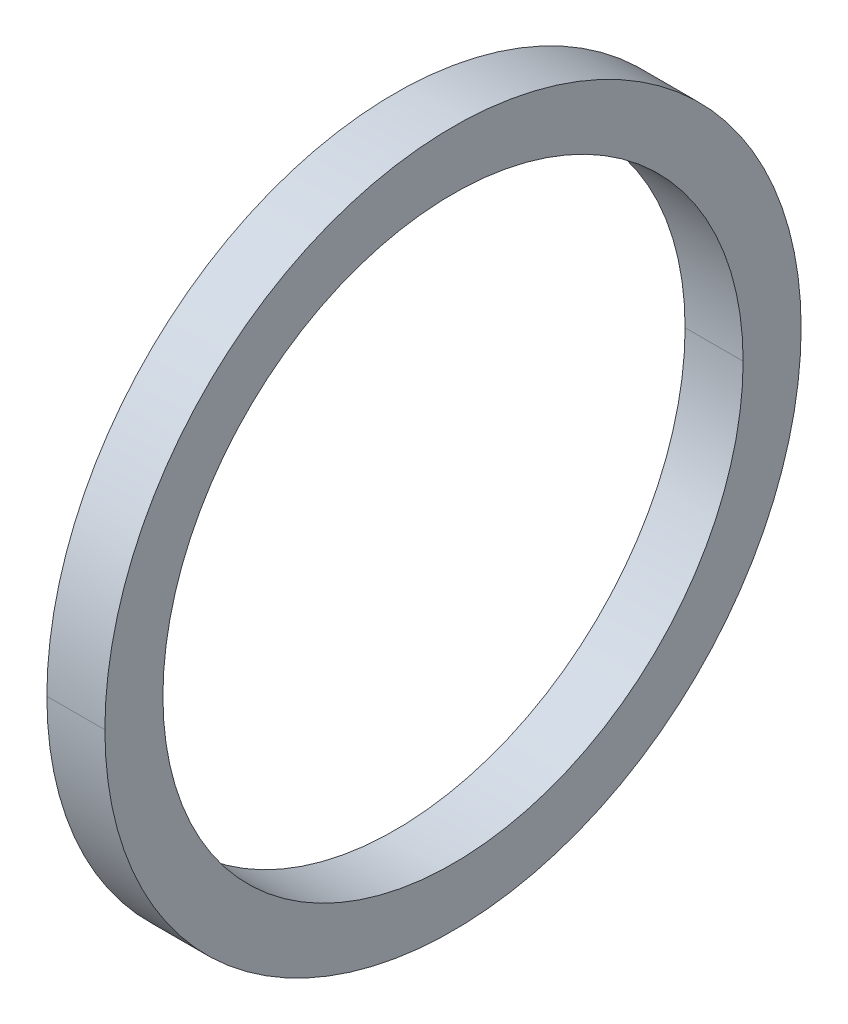
ISO-10303-21;
HEADER;
FILE_DESCRIPTION(('STEP AP214'),'2;1');
FILE_NAME('part.step','',(''),(''),'','','');
FILE_SCHEMA(('AUTOMOTIVE_DESIGN { 1 0 10303 214 1 1 1 1 }'));
ENDSEC;
DATA;
#1=APPLICATION_CONTEXT('core data for automotive mechanical design processes');
#2=APPLICATION_PROTOCOL_DEFINITION('international standard','automotive_design',2000,#1);
#3=PRODUCT_CONTEXT('',#1,'mechanical');
#4=PRODUCT('Part','Part','',(#3));
#5=PRODUCT_RELATED_PRODUCT_CATEGORY('part','',(#4));
#6=PRODUCT_DEFINITION_FORMATION('','',#4);
#7=PRODUCT_DEFINITION_CONTEXT('part definition',#1,'design');
#8=PRODUCT_DEFINITION('design','',#6,#7);
#9=PRODUCT_DEFINITION_SHAPE('','',#8);
#10=(LENGTH_UNIT() NAMED_UNIT(*) SI_UNIT(.MILLI.,.METRE.));
#11=(NAMED_UNIT(*) PLANE_ANGLE_UNIT() SI_UNIT($,.RADIAN.));
#12=(NAMED_UNIT(*) SI_UNIT($,.STERADIAN.) SOLID_ANGLE_UNIT());
#13=UNCERTAINTY_MEASURE_WITH_UNIT(LENGTH_MEASURE(1.E-05),#10,'distance_accuracy_value','');
#14=(GEOMETRIC_REPRESENTATION_CONTEXT(3) GLOBAL_UNCERTAINTY_ASSIGNED_CONTEXT((#13)) GLOBAL_UNIT_ASSIGNED_CONTEXT((#10,
#11,#12)) REPRESENTATION_CONTEXT('',''));
#15=CARTESIAN_POINT('',(0.,0.,0.));
#16=DIRECTION('',(0.,0.,1.));
#17=DIRECTION('',(1.,0.,0.));
#18=AXIS2_PLACEMENT_3D('',#15,#16,#17);
#19=CARTESIAN_POINT('',(0.,12.,0.));
#20=DIRECTION('',(-1.,0.,0.));
#21=DIRECTION('',(0.,0.,1.));
#22=AXIS2_PLACEMENT_3D('',#19,#20,#21);
#23=PLANE('',#22);
#24=CARTESIAN_POINT('',(0.,0.,0.));
#25=DIRECTION('',(1.,0.,0.));
#26=DIRECTION('',(0.,0.,-1.));
#27=AXIS2_PLACEMENT_3D('',#24,#25,#26);
#28=CIRCLE('',#27,10.);
#29=CARTESIAN_POINT('',(0.,0.,-10.));
#30=VERTEX_POINT('',#29);
#31=CARTESIAN_POINT('',(0.,0.,10.));
#32=VERTEX_POINT('',#31);
#33=EDGE_CURVE('E11',#30,#32,#28,.T.);
#34=ORIENTED_EDGE('',*,*,#33,.T.);
#35=CARTESIAN_POINT('',(0.,0.,0.));
#36=DIRECTION('',(1.,0.,0.));
#37=DIRECTION('',(0.,0.,-1.));
#38=AXIS2_PLACEMENT_3D('',#35,#36,#37);
#39=CIRCLE('',#38,10.);
#40=EDGE_CURVE('E26',#32,#30,#39,.T.);
#41=ORIENTED_EDGE('',*,*,#40,.T.);
#42=EDGE_LOOP('',(#34,#41));
#43=FACE_BOUND('',#42,.T.);
#44=CARTESIAN_POINT('',(0.,0.,0.));
#45=DIRECTION('',(1.,0.,0.));
#46=DIRECTION('',(0.,0.,-1.));
#47=AXIS2_PLACEMENT_3D('',#44,#45,#46);
#48=CIRCLE('',#47,12.);
#49=CARTESIAN_POINT('',(0.,0.,-12.));
#50=VERTEX_POINT('',#49);
#51=CARTESIAN_POINT('',(0.,0.,12.));
#52=VERTEX_POINT('',#51);
#53=EDGE_CURVE('E115',#50,#52,#48,.T.);
#54=ORIENTED_EDGE('',*,*,#53,.F.);
#55=CARTESIAN_POINT('',(0.,0.,0.));
#56=DIRECTION('',(1.,0.,0.));
#57=DIRECTION('',(0.,0.,-1.));
#58=AXIS2_PLACEMENT_3D('',#55,#56,#57);
#59=CIRCLE('',#58,12.);
#60=EDGE_CURVE('E110',#52,#50,#59,.T.);
#61=ORIENTED_EDGE('',*,*,#60,.F.);
#62=EDGE_LOOP('',(#54,#61));
#63=FACE_BOUND('',#62,.T.);
#64=ADVANCED_FACE('F17',(#43,#63),#23,.T.);
#65=CARTESIAN_POINT('',(2.,0.,0.));
#66=DIRECTION('',(-1.,0.,0.));
#67=DIRECTION('',(0.,1.,0.));
#68=AXIS2_PLACEMENT_3D('',#65,#66,#67);
#69=CYLINDRICAL_SURFACE('',#68,12.);
#70=ORIENTED_EDGE('',*,*,#60,.T.);
#71=DIRECTION('',(-1.,0.,0.));
#72=VECTOR('',#71,1.);
#73=CARTESIAN_POINT('',(2.,0.,-12.));
#74=LINE('',#73,#72);
#75=CARTESIAN_POINT('',(2.,0.,-12.));
#76=VERTEX_POINT('',#75);
#77=EDGE_CURVE('E104',#76,#50,#74,.T.);
#78=ORIENTED_EDGE('',*,*,#77,.F.);
#79=CARTESIAN_POINT('',(2.,0.,0.));
#80=DIRECTION('',(1.,0.,0.));
#81=DIRECTION('',(0.,0.,-1.));
#82=AXIS2_PLACEMENT_3D('',#79,#80,#81);
#83=CIRCLE('',#82,12.);
#84=CARTESIAN_POINT('',(2.,0.,12.));
#85=VERTEX_POINT('',#84);
#86=EDGE_CURVE('E98',#85,#76,#83,.T.);
#87=ORIENTED_EDGE('',*,*,#86,.F.);
#88=DIRECTION('',(-1.,0.,0.));
#89=VECTOR('',#88,1.);
#90=CARTESIAN_POINT('',(2.,0.,12.));
#91=LINE('',#90,#89);
#92=EDGE_CURVE('E86',#85,#52,#91,.T.);
#93=ORIENTED_EDGE('',*,*,#92,.T.);
#94=EDGE_LOOP('',(#70,#78,#87,#93));
#95=FACE_BOUND('',#94,.T.);
#96=ADVANCED_FACE('F140',(#95),#69,.T.);
#97=CARTESIAN_POINT('',(2.,0.,0.));
#98=DIRECTION('',(-1.,0.,0.));
#99=DIRECTION('',(0.,-1.,0.));
#100=AXIS2_PLACEMENT_3D('',#97,#98,#99);
#101=CYLINDRICAL_SURFACE('',#100,12.);
#102=CARTESIAN_POINT('',(2.,0.,0.));
#103=DIRECTION('',(1.,0.,0.));
#104=DIRECTION('',(0.,0.,-1.));
#105=AXIS2_PLACEMENT_3D('',#102,#103,#104);
#106=CIRCLE('',#105,12.);
#107=EDGE_CURVE('E80',#76,#85,#106,.T.);
#108=ORIENTED_EDGE('',*,*,#107,.F.);
#109=ORIENTED_EDGE('',*,*,#77,.T.);
#110=ORIENTED_EDGE('',*,*,#53,.T.);
#111=ORIENTED_EDGE('',*,*,#92,.F.);
#112=EDGE_LOOP('',(#108,#109,#110,#111));
#113=FACE_BOUND('',#112,.T.);
#114=ADVANCED_FACE('F137',(#113),#101,.T.);
#115=CARTESIAN_POINT('',(2.,10.,0.));
#116=DIRECTION('',(1.,0.,0.));
#117=DIRECTION('',(0.,0.,-1.));
#118=AXIS2_PLACEMENT_3D('',#115,#116,#117);
#119=PLANE('',#118);
#120=ORIENTED_EDGE('',*,*,#107,.T.);
#121=ORIENTED_EDGE('',*,*,#86,.T.);
#122=EDGE_LOOP('',(#120,#121));
#123=FACE_BOUND('',#122,.T.);
#124=CARTESIAN_POINT('',(2.,0.,0.));
#125=DIRECTION('',(1.,0.,0.));
#126=DIRECTION('',(0.,0.,-1.));
#127=AXIS2_PLACEMENT_3D('',#124,#125,#126);
#128=CIRCLE('',#127,10.);
#129=CARTESIAN_POINT('',(2.,0.,-10.));
#130=VERTEX_POINT('',#129);
#131=CARTESIAN_POINT('',(2.,0.,10.));
#132=VERTEX_POINT('',#131);
#133=EDGE_CURVE('E66',#130,#132,#128,.T.);
#134=ORIENTED_EDGE('',*,*,#133,.F.);
#135=CARTESIAN_POINT('',(2.,0.,0.));
#136=DIRECTION('',(1.,0.,0.));
#137=DIRECTION('',(0.,0.,-1.));
#138=AXIS2_PLACEMENT_3D('',#135,#136,#137);
#139=CIRCLE('',#138,10.);
#140=EDGE_CURVE('E62',#132,#130,#139,.T.);
#141=ORIENTED_EDGE('',*,*,#140,.F.);
#142=EDGE_LOOP('',(#134,#141));
#143=FACE_BOUND('',#142,.T.);
#144=ADVANCED_FACE('F64',(#123,#143),#119,.T.);
#145=CARTESIAN_POINT('',(2.,0.,0.));
#146=DIRECTION('',(-1.,0.,0.));
#147=DIRECTION('',(0.,1.,0.));
#148=AXIS2_PLACEMENT_3D('',#145,#146,#147);
#149=CYLINDRICAL_SURFACE('',#148,10.);
#150=ORIENTED_EDGE('',*,*,#40,.F.);
#151=DIRECTION('',(-1.,0.,0.));
#152=VECTOR('',#151,1.);
#153=CARTESIAN_POINT('',(2.,0.,10.));
#154=LINE('',#153,#152);
#155=EDGE_CURVE('E70',#132,#32,#154,.T.);
#156=ORIENTED_EDGE('',*,*,#155,.F.);
#157=ORIENTED_EDGE('',*,*,#140,.T.);
#158=DIRECTION('',(-1.,0.,0.));
#159=VECTOR('',#158,1.);
#160=CARTESIAN_POINT('',(2.,0.,-10.));
#161=LINE('',#160,#159);
#162=EDGE_CURVE('E76',#130,#30,#161,.T.);
#163=ORIENTED_EDGE('',*,*,#162,.T.);
#164=EDGE_LOOP('',(#150,#156,#157,#163));
#165=FACE_BOUND('',#164,.T.);
#166=ADVANCED_FACE('F73',(#165),#149,.F.);
#167=CARTESIAN_POINT('',(2.,0.,0.));
#168=DIRECTION('',(-1.,0.,0.));
#169=DIRECTION('',(0.,-1.,0.));
#170=AXIS2_PLACEMENT_3D('',#167,#168,#169);
#171=CYLINDRICAL_SURFACE('',#170,10.);
#172=ORIENTED_EDGE('',*,*,#133,.T.);
#173=ORIENTED_EDGE('',*,*,#155,.T.);
#174=ORIENTED_EDGE('',*,*,#33,.F.);
#175=ORIENTED_EDGE('',*,*,#162,.F.);
#176=EDGE_LOOP('',(#172,#173,#174,#175));
#177=FACE_BOUND('',#176,.T.);
#178=ADVANCED_FACE('F78',(#177),#171,.F.);
#179=CLOSED_SHELL('',(#64,#96,#114,#144,#166,#178));
#180=MANIFOLD_SOLID_BREP('B1',#179);
#181=ADVANCED_BREP_SHAPE_REPRESENTATION('',(#18,#180),#14);
#182=SHAPE_DEFINITION_REPRESENTATION(#9,#181);
ENDSEC;
END-ISO-10303-21;
